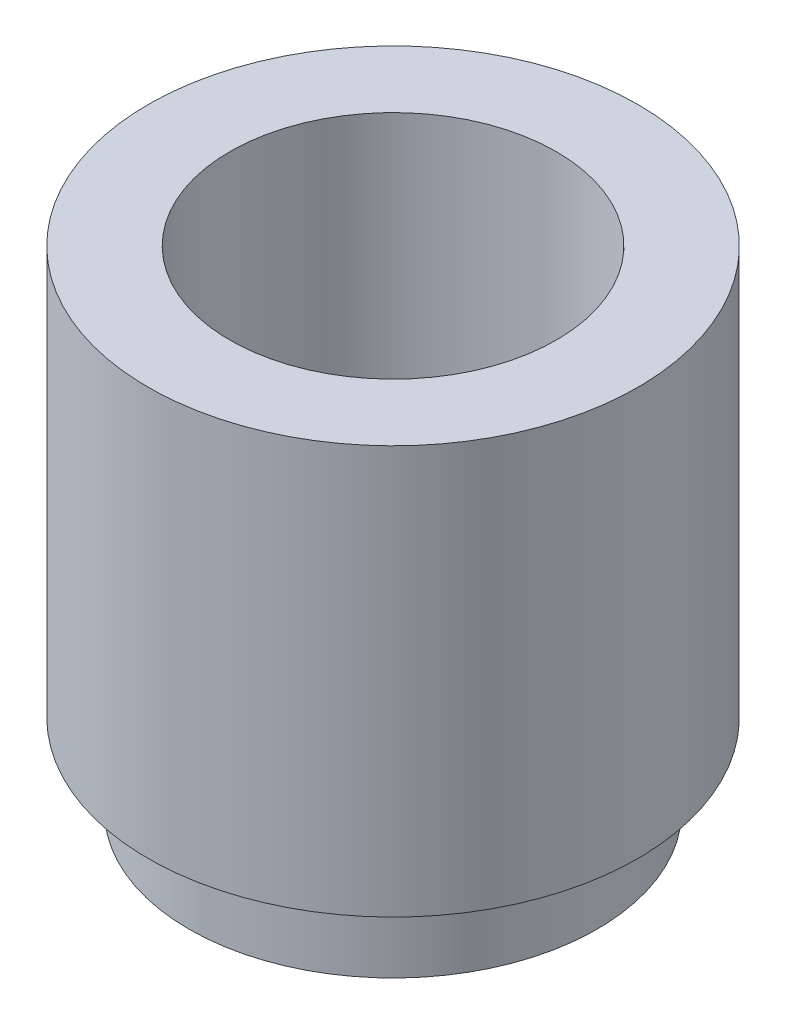
ISO-10303-21;
HEADER;
FILE_DESCRIPTION(('STEP AP214'),'2;1');
FILE_NAME('part.step','',(''),(''),'','','');
FILE_SCHEMA(('AUTOMOTIVE_DESIGN { 1 0 10303 214 1 1 1 1 }'));
ENDSEC;
DATA;
#1=APPLICATION_CONTEXT('core data for automotive mechanical design processes');
#2=APPLICATION_PROTOCOL_DEFINITION('international standard','automotive_design',2000,#1);
#3=PRODUCT_CONTEXT('',#1,'mechanical');
#4=PRODUCT('Part','Part','',(#3));
#5=PRODUCT_RELATED_PRODUCT_CATEGORY('part','',(#4));
#6=PRODUCT_DEFINITION_FORMATION('','',#4);
#7=PRODUCT_DEFINITION_CONTEXT('part definition',#1,'design');
#8=PRODUCT_DEFINITION('design','',#6,#7);
#9=PRODUCT_DEFINITION_SHAPE('','',#8);
#10=(LENGTH_UNIT() NAMED_UNIT(*) SI_UNIT(.MILLI.,.METRE.));
#11=(NAMED_UNIT(*) PLANE_ANGLE_UNIT() SI_UNIT($,.RADIAN.));
#12=(NAMED_UNIT(*) SI_UNIT($,.STERADIAN.) SOLID_ANGLE_UNIT());
#13=UNCERTAINTY_MEASURE_WITH_UNIT(LENGTH_MEASURE(1.E-05),#10,'distance_accuracy_value','');
#14=(GEOMETRIC_REPRESENTATION_CONTEXT(3) GLOBAL_UNCERTAINTY_ASSIGNED_CONTEXT((#13)) GLOBAL_UNIT_ASSIGNED_CONTEXT((#10,
#11,#12)) REPRESENTATION_CONTEXT('',''));
#15=CARTESIAN_POINT('',(0.,0.,0.));
#16=DIRECTION('',(0.,0.,1.));
#17=DIRECTION('',(1.,0.,0.));
#18=AXIS2_PLACEMENT_3D('',#15,#16,#17);
#19=CARTESIAN_POINT('',(0.,6.,-3.));
#20=DIRECTION('',(0.,1.,0.));
#21=DIRECTION('',(0.,0.,1.));
#22=AXIS2_PLACEMENT_3D('',#19,#20,#21);
#23=PLANE('',#22);
#24=CARTESIAN_POINT('',(0.,6.,0.));
#25=DIRECTION('',(0.,-1.,0.));
#26=DIRECTION('',(0.,0.,-1.));
#27=AXIS2_PLACEMENT_3D('',#24,#25,#26);
#28=CIRCLE('',#27,2.);
#29=CARTESIAN_POINT('',(0.,6.,-2.));
#30=VERTEX_POINT('',#29);
#31=EDGE_CURVE('E10',#30,#30,#28,.T.);
#32=ORIENTED_EDGE('',*,*,#31,.T.);
#33=EDGE_LOOP('',(#32));
#34=FACE_BOUND('',#33,.T.);
#35=CARTESIAN_POINT('',(0.,6.,0.));
#36=DIRECTION('',(0.,-1.,0.));
#37=DIRECTION('',(0.,0.,-1.));
#38=AXIS2_PLACEMENT_3D('',#35,#36,#37);
#39=CIRCLE('',#38,3.);
#40=CARTESIAN_POINT('',(0.,6.,-3.));
#41=VERTEX_POINT('',#40);
#42=EDGE_CURVE('E57',#41,#41,#39,.T.);
#43=ORIENTED_EDGE('',*,*,#42,.F.);
#44=EDGE_LOOP('',(#43));
#45=FACE_BOUND('',#44,.T.);
#46=ADVANCED_FACE('F35',(#34,#45),#23,.T.);
#47=CARTESIAN_POINT('',(0.,0.,0.));
#48=DIRECTION('',(0.,-1.,0.));
#49=DIRECTION('',(0.,0.,-1.));
#50=AXIS2_PLACEMENT_3D('',#47,#48,#49);
#51=CYLINDRICAL_SURFACE('',#50,2.);
#52=CARTESIAN_POINT('',(0.,0.,0.));
#53=DIRECTION('',(0.,-1.,0.));
#54=DIRECTION('',(0.,0.,-1.));
#55=AXIS2_PLACEMENT_3D('',#52,#53,#54);
#56=CIRCLE('',#55,2.);
#57=CARTESIAN_POINT('',(0.,0.,-2.));
#58=VERTEX_POINT('',#57);
#59=EDGE_CURVE('E41',#58,#58,#56,.T.);
#60=ORIENTED_EDGE('',*,*,#59,.T.);
#61=EDGE_LOOP('',(#60));
#62=FACE_BOUND('',#61,.T.);
#63=ORIENTED_EDGE('',*,*,#31,.F.);
#64=EDGE_LOOP('',(#63));
#65=FACE_BOUND('',#64,.T.);
#66=ADVANCED_FACE('F65',(#62,#65),#51,.F.);
#67=CARTESIAN_POINT('',(0.,0.,-2.));
#68=DIRECTION('',(0.,-1.,0.));
#69=DIRECTION('',(0.,0.,-1.));
#70=AXIS2_PLACEMENT_3D('',#67,#68,#69);
#71=PLANE('',#70);
#72=CARTESIAN_POINT('',(0.,0.,0.));
#73=DIRECTION('',(0.,-1.,0.));
#74=DIRECTION('',(0.,0.,-1.));
#75=AXIS2_PLACEMENT_3D('',#72,#73,#74);
#76=CIRCLE('',#75,2.5);
#77=CARTESIAN_POINT('',(0.,0.,-2.5));
#78=VERTEX_POINT('',#77);
#79=EDGE_CURVE('E45',#78,#78,#76,.T.);
#80=ORIENTED_EDGE('',*,*,#79,.T.);
#81=EDGE_LOOP('',(#80));
#82=FACE_BOUND('',#81,.T.);
#83=ORIENTED_EDGE('',*,*,#59,.F.);
#84=EDGE_LOOP('',(#83));
#85=FACE_BOUND('',#84,.T.);
#86=ADVANCED_FACE('F69',(#82,#85),#71,.T.);
#87=CARTESIAN_POINT('',(0.,0.,0.));
#88=DIRECTION('',(0.,-1.,0.));
#89=DIRECTION('',(0.,0.,-1.));
#90=AXIS2_PLACEMENT_3D('',#87,#88,#89);
#91=CYLINDRICAL_SURFACE('',#90,2.5);
#92=CARTESIAN_POINT('',(0.,1.,0.));
#93=DIRECTION('',(0.,-1.,0.));
#94=DIRECTION('',(0.,0.,-1.));
#95=AXIS2_PLACEMENT_3D('',#92,#93,#94);
#96=CIRCLE('',#95,2.5);
#97=CARTESIAN_POINT('',(0.,1.,-2.5));
#98=VERTEX_POINT('',#97);
#99=EDGE_CURVE('E49',#98,#98,#96,.T.);
#100=ORIENTED_EDGE('',*,*,#99,.T.);
#101=EDGE_LOOP('',(#100));
#102=FACE_BOUND('',#101,.T.);
#103=ORIENTED_EDGE('',*,*,#79,.F.);
#104=EDGE_LOOP('',(#103));
#105=FACE_BOUND('',#104,.T.);
#106=ADVANCED_FACE('F73',(#102,#105),#91,.T.);
#107=CARTESIAN_POINT('',(0.,1.,-2.5));
#108=DIRECTION('',(0.,-1.,0.));
#109=DIRECTION('',(0.,0.,-1.));
#110=AXIS2_PLACEMENT_3D('',#107,#108,#109);
#111=PLANE('',#110);
#112=CARTESIAN_POINT('',(0.,1.,0.));
#113=DIRECTION('',(0.,-1.,0.));
#114=DIRECTION('',(0.,0.,-1.));
#115=AXIS2_PLACEMENT_3D('',#112,#113,#114);
#116=CIRCLE('',#115,3.);
#117=CARTESIAN_POINT('',(0.,1.,-3.));
#118=VERTEX_POINT('',#117);
#119=EDGE_CURVE('E54',#118,#118,#116,.T.);
#120=ORIENTED_EDGE('',*,*,#119,.T.);
#121=EDGE_LOOP('',(#120));
#122=FACE_BOUND('',#121,.T.);
#123=ORIENTED_EDGE('',*,*,#99,.F.);
#124=EDGE_LOOP('',(#123));
#125=FACE_BOUND('',#124,.T.);
#126=ADVANCED_FACE('F80',(#122,#125),#111,.T.);
#127=CARTESIAN_POINT('',(0.,0.,0.));
#128=DIRECTION('',(0.,-1.,0.));
#129=DIRECTION('',(0.,0.,-1.));
#130=AXIS2_PLACEMENT_3D('',#127,#128,#129);
#131=CYLINDRICAL_SURFACE('',#130,3.);
#132=ORIENTED_EDGE('',*,*,#42,.T.);
#133=EDGE_LOOP('',(#132));
#134=FACE_BOUND('',#133,.T.);
#135=ORIENTED_EDGE('',*,*,#119,.F.);
#136=EDGE_LOOP('',(#135));
#137=FACE_BOUND('',#136,.T.);
#138=ADVANCED_FACE('F61',(#134,#137),#131,.T.);
#139=CLOSED_SHELL('',(#46,#66,#86,#106,#126,#138));
#140=MANIFOLD_SOLID_BREP('B2',#139);
#141=ADVANCED_BREP_SHAPE_REPRESENTATION('',(#18,#140),#14);
#142=SHAPE_DEFINITION_REPRESENTATION(#9,#141);
ENDSEC;
END-ISO-10303-21;
